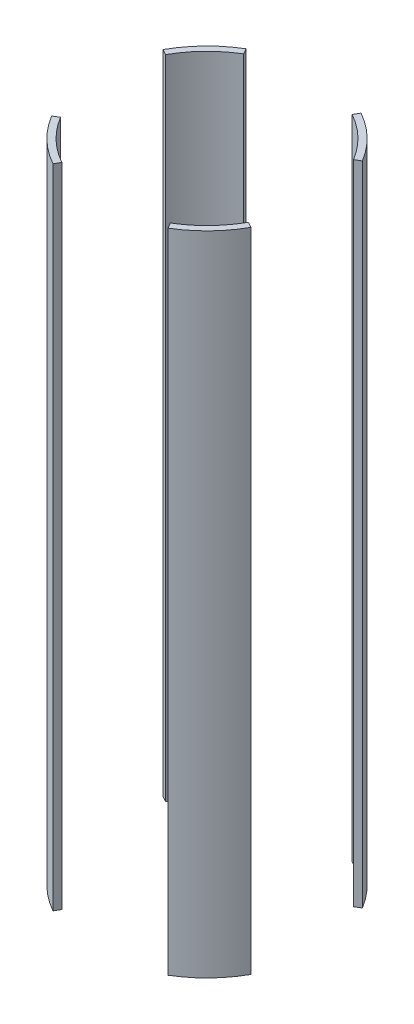
ISO-10303-21;
HEADER;
FILE_DESCRIPTION(('STEP AP214'),'2;1');
FILE_NAME('part.step','',(''),(''),'','','');
FILE_SCHEMA(('AUTOMOTIVE_DESIGN { 1 0 10303 214 1 1 1 1 }'));
ENDSEC;
DATA;
#1=APPLICATION_CONTEXT('core data for automotive mechanical design processes');
#2=APPLICATION_PROTOCOL_DEFINITION('international standard','automotive_design',2000,#1);
#3=PRODUCT_CONTEXT('',#1,'mechanical');
#4=PRODUCT('Part','Part','',(#3));
#5=PRODUCT_RELATED_PRODUCT_CATEGORY('part','',(#4));
#6=PRODUCT_DEFINITION_FORMATION('','',#4);
#7=PRODUCT_DEFINITION_CONTEXT('part definition',#1,'design');
#8=PRODUCT_DEFINITION('design','',#6,#7);
#9=PRODUCT_DEFINITION_SHAPE('','',#8);
#10=(LENGTH_UNIT() NAMED_UNIT(*) SI_UNIT(.MILLI.,.METRE.));
#11=(NAMED_UNIT(*) PLANE_ANGLE_UNIT() SI_UNIT($,.RADIAN.));
#12=(NAMED_UNIT(*) SI_UNIT($,.STERADIAN.) SOLID_ANGLE_UNIT());
#13=UNCERTAINTY_MEASURE_WITH_UNIT(LENGTH_MEASURE(1.E-05),#10,'distance_accuracy_value','');
#14=(GEOMETRIC_REPRESENTATION_CONTEXT(3) GLOBAL_UNCERTAINTY_ASSIGNED_CONTEXT((#13)) GLOBAL_UNIT_ASSIGNED_CONTEXT((#10,
#11,#12)) REPRESENTATION_CONTEXT('',''));
#15=CARTESIAN_POINT('',(0.,0.,0.));
#16=DIRECTION('',(0.,0.,1.));
#17=DIRECTION('',(1.,0.,0.));
#18=AXIS2_PLACEMENT_3D('',#15,#16,#17);
#19=CARTESIAN_POINT('',(0.,-254.,0.));
#20=DIRECTION('',(0.,1.,0.));
#21=DIRECTION('',(0.,0.,1.));
#22=AXIS2_PLACEMENT_3D('',#19,#20,#21);
#23=PLANE('',#22);
#24=DIRECTION('',(0.48581550952375,0.,-0.874061376967418));
#25=VECTOR('',#24,1.);
#26=CARTESIAN_POINT('',(0.,-254.,0.));
#27=LINE('',#26,#25);
#28=CARTESIAN_POINT('',(-43.1889987966614,-254.,77.7040564124034));
#29=VERTEX_POINT('',#28);
#30=CARTESIAN_POINT('',(-40.7210560082808,-254.,73.263824617409));
#31=VERTEX_POINT('',#30);
#32=EDGE_CURVE('E13',#29,#31,#27,.T.);
#33=ORIENTED_EDGE('',*,*,#32,.F.);
#34=CARTESIAN_POINT('',(0.,-254.,0.));
#35=DIRECTION('',(0.,1.,0.));
#36=DIRECTION('',(0.,0.,1.));
#37=AXIS2_PLACEMENT_3D('',#34,#35,#36);
#38=CIRCLE('',#37,88.9);
#39=CARTESIAN_POINT('',(-76.2547983281261,-254.,45.6991874319097));
#40=VERTEX_POINT('',#39);
#41=EDGE_CURVE('E274',#40,#29,#38,.T.);
#42=ORIENTED_EDGE('',*,*,#41,.F.);
#43=DIRECTION('',(0.857759261283758,0.,-0.514051602158714));
#44=VECTOR('',#43,1.);
#45=CARTESIAN_POINT('',(0.,-254.,0.));
#46=LINE('',#45,#44);
#47=CARTESIAN_POINT('',(-71.8973812808046,-254.,43.0878052929434));
#48=VERTEX_POINT('',#47);
#49=EDGE_CURVE('E269',#40,#48,#46,.T.);
#50=ORIENTED_EDGE('',*,*,#49,.T.);
#51=CARTESIAN_POINT('',(0.,-254.,0.));
#52=DIRECTION('',(0.,1.,0.));
#53=DIRECTION('',(0.,0.,1.));
#54=AXIS2_PLACEMENT_3D('',#51,#52,#53);
#55=CIRCLE('',#54,83.82);
#56=EDGE_CURVE('E228',#48,#31,#55,.T.);
#57=ORIENTED_EDGE('',*,*,#56,.T.);
#58=EDGE_LOOP('',(#33,#42,#50,#57));
#59=FACE_BOUND('',#58,.T.);
#60=ADVANCED_FACE('F225',(#59),#23,.F.);
#61=CARTESIAN_POINT('',(0.,254.,0.));
#62=DIRECTION('',(0.,1.,0.));
#63=DIRECTION('',(0.,0.,1.));
#64=AXIS2_PLACEMENT_3D('',#61,#62,#63);
#65=PLANE('',#64);
#66=CARTESIAN_POINT('',(0.,254.,0.));
#67=DIRECTION('',(0.,1.,0.));
#68=DIRECTION('',(0.,0.,1.));
#69=AXIS2_PLACEMENT_3D('',#66,#67,#68);
#70=CIRCLE('',#69,88.9);
#71=CARTESIAN_POINT('',(-76.2547983281261,254.,45.6991874319097));
#72=VERTEX_POINT('',#71);
#73=CARTESIAN_POINT('',(-43.1889987966614,254.,77.7040564124034));
#74=VERTEX_POINT('',#73);
#75=EDGE_CURVE('E280',#72,#74,#70,.T.);
#76=ORIENTED_EDGE('',*,*,#75,.T.);
#77=DIRECTION('',(0.48581550952375,0.,-0.874061376967418));
#78=VECTOR('',#77,1.);
#79=CARTESIAN_POINT('',(0.,254.,0.));
#80=LINE('',#79,#78);
#81=CARTESIAN_POINT('',(-40.7210560082808,254.,73.263824617409));
#82=VERTEX_POINT('',#81);
#83=EDGE_CURVE('E241',#74,#82,#80,.T.);
#84=ORIENTED_EDGE('',*,*,#83,.T.);
#85=CARTESIAN_POINT('',(0.,254.,0.));
#86=DIRECTION('',(0.,1.,0.));
#87=DIRECTION('',(0.,0.,1.));
#88=AXIS2_PLACEMENT_3D('',#85,#86,#87);
#89=CIRCLE('',#88,83.82);
#90=CARTESIAN_POINT('',(-71.8973812808046,254.,43.0878052929434));
#91=VERTEX_POINT('',#90);
#92=EDGE_CURVE('E282',#91,#82,#89,.T.);
#93=ORIENTED_EDGE('',*,*,#92,.F.);
#94=DIRECTION('',(0.857759261283758,0.,-0.514051602158714));
#95=VECTOR('',#94,1.);
#96=CARTESIAN_POINT('',(0.,254.,0.));
#97=LINE('',#96,#95);
#98=EDGE_CURVE('E266',#72,#91,#97,.T.);
#99=ORIENTED_EDGE('',*,*,#98,.F.);
#100=EDGE_LOOP('',(#76,#84,#93,#99));
#101=FACE_BOUND('',#100,.T.);
#102=ADVANCED_FACE('F279',(#101),#65,.T.);
#103=CARTESIAN_POINT('',(0.,254.,0.));
#104=DIRECTION('',(0.,-1.,0.));
#105=DIRECTION('',(0.,0.,-1.));
#106=AXIS2_PLACEMENT_3D('',#103,#104,#105);
#107=CYLINDRICAL_SURFACE('',#106,88.9);
#108=DIRECTION('',(0.,-1.,0.));
#109=VECTOR('',#108,1.);
#110=CARTESIAN_POINT('',(-43.1889987966614,254.,77.7040564124034));
#111=LINE('',#110,#109);
#112=EDGE_CURVE('E233',#74,#29,#111,.T.);
#113=ORIENTED_EDGE('',*,*,#112,.F.);
#114=ORIENTED_EDGE('',*,*,#75,.F.);
#115=DIRECTION('',(0.,-1.,0.));
#116=VECTOR('',#115,1.);
#117=CARTESIAN_POINT('',(-76.2547983281261,254.,45.6991874319097));
#118=LINE('',#117,#116);
#119=EDGE_CURVE('E263',#72,#40,#118,.T.);
#120=ORIENTED_EDGE('',*,*,#119,.T.);
#121=ORIENTED_EDGE('',*,*,#41,.T.);
#122=EDGE_LOOP('',(#113,#114,#120,#121));
#123=FACE_BOUND('',#122,.T.);
#124=ADVANCED_FACE('F285',(#123),#107,.T.);
#125=CARTESIAN_POINT('',(0.,254.,0.));
#126=DIRECTION('',(0.,-1.,0.));
#127=DIRECTION('',(0.,0.,-1.));
#128=AXIS2_PLACEMENT_3D('',#125,#126,#127);
#129=CYLINDRICAL_SURFACE('',#128,83.82);
#130=ORIENTED_EDGE('',*,*,#92,.T.);
#131=DIRECTION('',(0.,-1.,0.));
#132=VECTOR('',#131,1.);
#133=CARTESIAN_POINT('',(-40.7210560082808,254.,73.263824617409));
#134=LINE('',#133,#132);
#135=EDGE_CURVE('E245',#82,#31,#134,.T.);
#136=ORIENTED_EDGE('',*,*,#135,.T.);
#137=ORIENTED_EDGE('',*,*,#56,.F.);
#138=DIRECTION('',(0.,-1.,0.));
#139=VECTOR('',#138,1.);
#140=CARTESIAN_POINT('',(-71.8973812808046,254.,43.0878052929434));
#141=LINE('',#140,#139);
#142=EDGE_CURVE('E283',#91,#48,#141,.T.);
#143=ORIENTED_EDGE('',*,*,#142,.F.);
#144=EDGE_LOOP('',(#130,#136,#137,#143));
#145=FACE_BOUND('',#144,.T.);
#146=ADVANCED_FACE('F299',(#145),#129,.F.);
#147=CARTESIAN_POINT('',(0.,-254.,0.));
#148=DIRECTION('',(0.514051602158714,0.,0.857759261283758));
#149=DIRECTION('',(0.857759261283758,0.,-0.514051602158714));
#150=AXIS2_PLACEMENT_3D('',#147,#148,#149);
#151=PLANE('',#150);
#152=ORIENTED_EDGE('',*,*,#142,.T.);
#153=ORIENTED_EDGE('',*,*,#49,.F.);
#154=ORIENTED_EDGE('',*,*,#119,.F.);
#155=ORIENTED_EDGE('',*,*,#98,.T.);
#156=EDGE_LOOP('',(#152,#153,#154,#155));
#157=FACE_BOUND('',#156,.T.);
#158=ADVANCED_FACE('F265',(#157),#151,.F.);
#159=CARTESIAN_POINT('',(0.,-254.,0.));
#160=DIRECTION('',(0.874061376967418,0.,0.48581550952375));
#161=DIRECTION('',(0.48581550952375,0.,-0.874061376967418));
#162=AXIS2_PLACEMENT_3D('',#159,#160,#161);
#163=PLANE('',#162);
#164=ORIENTED_EDGE('',*,*,#112,.T.);
#165=ORIENTED_EDGE('',*,*,#32,.T.);
#166=ORIENTED_EDGE('',*,*,#135,.F.);
#167=ORIENTED_EDGE('',*,*,#83,.F.);
#168=EDGE_LOOP('',(#164,#165,#166,#167));
#169=FACE_BOUND('',#168,.T.);
#170=ADVANCED_FACE('F297',(#169),#163,.T.);
#171=CLOSED_SHELL('',(#60,#102,#124,#146,#158,#170));
#172=MANIFOLD_SOLID_BREP('B2',#171);
#173=CARTESIAN_POINT('',(0.,254.,0.));
#174=DIRECTION('',(0.,-1.,0.));
#175=DIRECTION('',(0.,0.,-1.));
#176=AXIS2_PLACEMENT_3D('',#173,#174,#175);
#177=CYLINDRICAL_SURFACE('',#176,83.82);
#178=DIRECTION('',(0.,-1.,0.));
#179=VECTOR('',#178,1.);
#180=CARTESIAN_POINT('',(-73.2638246174091,254.,-40.7210560082805));
#181=LINE('',#180,#179);
#182=CARTESIAN_POINT('',(-73.2638246174091,-254.,-40.7210560082805));
#183=VERTEX_POINT('',#182);
#184=CARTESIAN_POINT('',(-73.2638246174091,254.,-40.7210560082805));
#185=VERTEX_POINT('',#184);
#186=EDGE_CURVE('E367',#183,#185,#181,.F.);
#187=ORIENTED_EDGE('',*,*,#186,.F.);
#188=CARTESIAN_POINT('',(0.,-254.,0.));
#189=DIRECTION('',(0.,1.,0.));
#190=DIRECTION('',(0.,0.,1.));
#191=AXIS2_PLACEMENT_3D('',#188,#189,#190);
#192=CIRCLE('',#191,83.82);
#193=CARTESIAN_POINT('',(-43.0878052929431,-254.,-71.8973812808048));
#194=VERTEX_POINT('',#193);
#195=EDGE_CURVE('E361',#194,#183,#192,.T.);
#196=ORIENTED_EDGE('',*,*,#195,.F.);
#197=DIRECTION('',(0.,-1.,0.));
#198=VECTOR('',#197,1.);
#199=CARTESIAN_POINT('',(-43.0878052929431,254.,-71.8973812808048));
#200=LINE('',#199,#198);
#201=CARTESIAN_POINT('',(-43.0878052929431,254.,-71.8973812808048));
#202=VERTEX_POINT('',#201);
#203=EDGE_CURVE('E415',#202,#194,#200,.T.);
#204=ORIENTED_EDGE('',*,*,#203,.F.);
#205=CARTESIAN_POINT('',(0.,254.,0.));
#206=DIRECTION('',(0.,1.,0.));
#207=DIRECTION('',(0.,0.,1.));
#208=AXIS2_PLACEMENT_3D('',#205,#206,#207);
#209=CIRCLE('',#208,83.82);
#210=EDGE_CURVE('E421',#202,#185,#209,.T.);
#211=ORIENTED_EDGE('',*,*,#210,.T.);
#212=EDGE_LOOP('',(#187,#196,#204,#211));
#213=FACE_BOUND('',#212,.T.);
#214=ADVANCED_FACE('F358',(#213),#177,.F.);
#215=CARTESIAN_POINT('',(0.,254.,0.));
#216=DIRECTION('',(0.,-1.,0.));
#217=DIRECTION('',(0.,0.,-1.));
#218=AXIS2_PLACEMENT_3D('',#215,#216,#217);
#219=CYLINDRICAL_SURFACE('',#218,88.9);
#220=CARTESIAN_POINT('',(0.,-254.,0.));
#221=DIRECTION('',(0.,1.,0.));
#222=DIRECTION('',(0.,0.,1.));
#223=AXIS2_PLACEMENT_3D('',#220,#221,#222);
#224=CIRCLE('',#223,88.9);
#225=CARTESIAN_POINT('',(-45.6991874319094,-254.,-76.2547983281263));
#226=VERTEX_POINT('',#225);
#227=CARTESIAN_POINT('',(-77.7040564124036,-254.,-43.1889987966612));
#228=VERTEX_POINT('',#227);
#229=EDGE_CURVE('E407',#226,#228,#224,.T.);
#230=ORIENTED_EDGE('',*,*,#229,.T.);
#231=DIRECTION('',(0.,-1.,0.));
#232=VECTOR('',#231,1.);
#233=CARTESIAN_POINT('',(-77.7040564124036,254.,-43.1889987966611));
#234=LINE('',#233,#232);
#235=CARTESIAN_POINT('',(-77.7040564124036,254.,-43.1889987966612));
#236=VERTEX_POINT('',#235);
#237=EDGE_CURVE('E395',#228,#236,#234,.F.);
#238=ORIENTED_EDGE('',*,*,#237,.T.);
#239=CARTESIAN_POINT('',(0.,254.,0.));
#240=DIRECTION('',(0.,1.,0.));
#241=DIRECTION('',(0.,0.,1.));
#242=AXIS2_PLACEMENT_3D('',#239,#240,#241);
#243=CIRCLE('',#242,88.9);
#244=CARTESIAN_POINT('',(-45.6991874319094,254.,-76.2547983281263));
#245=VERTEX_POINT('',#244);
#246=EDGE_CURVE('E405',#245,#236,#243,.T.);
#247=ORIENTED_EDGE('',*,*,#246,.F.);
#248=DIRECTION('',(0.,-1.,0.));
#249=VECTOR('',#248,1.);
#250=CARTESIAN_POINT('',(-45.6991874319094,254.,-76.2547983281263));
#251=LINE('',#250,#249);
#252=EDGE_CURVE('E408',#245,#226,#251,.T.);
#253=ORIENTED_EDGE('',*,*,#252,.T.);
#254=EDGE_LOOP('',(#230,#238,#247,#253));
#255=FACE_BOUND('',#254,.T.);
#256=ADVANCED_FACE('F403',(#255),#219,.T.);
#257=CARTESIAN_POINT('',(0.,-254.,0.));
#258=DIRECTION('',(0.,1.,0.));
#259=DIRECTION('',(0.,0.,1.));
#260=AXIS2_PLACEMENT_3D('',#257,#258,#259);
#261=PLANE('',#260);
#262=ORIENTED_EDGE('',*,*,#195,.T.);
#263=DIRECTION('',(-0.87406137696742,0.,-0.485815509523748));
#264=VECTOR('',#263,1.);
#265=CARTESIAN_POINT('',(0.,-254.,0.));
#266=LINE('',#265,#264);
#267=EDGE_CURVE('E375',#183,#228,#266,.T.);
#268=ORIENTED_EDGE('',*,*,#267,.T.);
#269=ORIENTED_EDGE('',*,*,#229,.F.);
#270=DIRECTION('',(0.514051602158711,0.,0.85775926128376));
#271=VECTOR('',#270,1.);
#272=CARTESIAN_POINT('',(0.,-254.,0.));
#273=LINE('',#272,#271);
#274=EDGE_CURVE('E413',#226,#194,#273,.T.);
#275=ORIENTED_EDGE('',*,*,#274,.T.);
#276=EDGE_LOOP('',(#262,#268,#269,#275));
#277=FACE_BOUND('',#276,.T.);
#278=ADVANCED_FACE('F431',(#277),#261,.F.);
#279=CARTESIAN_POINT('',(0.,254.,0.));
#280=DIRECTION('',(0.,1.,0.));
#281=DIRECTION('',(0.,0.,1.));
#282=AXIS2_PLACEMENT_3D('',#279,#280,#281);
#283=PLANE('',#282);
#284=DIRECTION('',(-0.87406137696742,0.,-0.485815509523748));
#285=VECTOR('',#284,1.);
#286=CARTESIAN_POINT('',(0.,254.,0.));
#287=LINE('',#286,#285);
#288=EDGE_CURVE('E223',#185,#236,#287,.T.);
#289=ORIENTED_EDGE('',*,*,#288,.F.);
#290=ORIENTED_EDGE('',*,*,#210,.F.);
#291=DIRECTION('',(0.514051602158711,0.,0.85775926128376));
#292=VECTOR('',#291,1.);
#293=CARTESIAN_POINT('',(0.,254.,0.));
#294=LINE('',#293,#292);
#295=EDGE_CURVE('E412',#245,#202,#294,.T.);
#296=ORIENTED_EDGE('',*,*,#295,.F.);
#297=ORIENTED_EDGE('',*,*,#246,.T.);
#298=EDGE_LOOP('',(#289,#290,#296,#297));
#299=FACE_BOUND('',#298,.T.);
#300=ADVANCED_FACE('F411',(#299),#283,.T.);
#301=CARTESIAN_POINT('',(0.,-254.,0.));
#302=DIRECTION('',(-0.85775926128376,0.,0.514051602158711));
#303=DIRECTION('',(0.514051602158711,0.,0.85775926128376));
#304=AXIS2_PLACEMENT_3D('',#301,#302,#303);
#305=PLANE('',#304);
#306=ORIENTED_EDGE('',*,*,#295,.T.);
#307=ORIENTED_EDGE('',*,*,#203,.T.);
#308=ORIENTED_EDGE('',*,*,#274,.F.);
#309=ORIENTED_EDGE('',*,*,#252,.F.);
#310=EDGE_LOOP('',(#306,#307,#308,#309));
#311=FACE_BOUND('',#310,.T.);
#312=ADVANCED_FACE('F432',(#311),#305,.F.);
#313=CARTESIAN_POINT('',(0.,-254.,0.));
#314=DIRECTION('',(0.485815509523747,0.,-0.87406137696742));
#315=DIRECTION('',(-0.87406137696742,0.,-0.485815509523748));
#316=AXIS2_PLACEMENT_3D('',#313,#314,#315);
#317=PLANE('',#316);
#318=ORIENTED_EDGE('',*,*,#186,.T.);
#319=ORIENTED_EDGE('',*,*,#288,.T.);
#320=ORIENTED_EDGE('',*,*,#237,.F.);
#321=ORIENTED_EDGE('',*,*,#267,.F.);
#322=EDGE_LOOP('',(#318,#319,#320,#321));
#323=FACE_BOUND('',#322,.T.);
#324=ADVANCED_FACE('F394',(#323),#317,.F.);
#325=CLOSED_SHELL('',(#214,#256,#278,#300,#312,#324));
#326=MANIFOLD_SOLID_BREP('B7',#325);
#327=CARTESIAN_POINT('',(0.,254.,0.));
#328=DIRECTION('',(0.,1.,0.));
#329=DIRECTION('',(0.,0.,1.));
#330=AXIS2_PLACEMENT_3D('',#327,#328,#329);
#331=PLANE('',#330);
#332=DIRECTION('',(0.485815509523751,0.,-0.874061376967418));
#333=VECTOR('',#332,1.);
#334=CARTESIAN_POINT('',(0.,254.,0.));
#335=LINE('',#334,#333);
#336=CARTESIAN_POINT('',(40.7210560082808,254.,-73.2638246174089));
#337=VERTEX_POINT('',#336);
#338=CARTESIAN_POINT('',(43.1889987966614,254.,-77.7040564124034));
#339=VERTEX_POINT('',#338);
#340=EDGE_CURVE('E356',#337,#339,#335,.T.);
#341=ORIENTED_EDGE('',*,*,#340,.F.);
#342=CARTESIAN_POINT('',(0.,254.,0.));
#343=DIRECTION('',(0.,1.,0.));
#344=DIRECTION('',(0.,0.,1.));
#345=AXIS2_PLACEMENT_3D('',#342,#343,#344);
#346=CIRCLE('',#345,83.82);
#347=CARTESIAN_POINT('',(71.8973812808046,254.,-43.0878052929434));
#348=VERTEX_POINT('',#347);
#349=EDGE_CURVE('E538',#348,#337,#346,.T.);
#350=ORIENTED_EDGE('',*,*,#349,.F.);
#351=DIRECTION('',(0.857759261283759,0.,-0.514051602158714));
#352=VECTOR('',#351,1.);
#353=CARTESIAN_POINT('',(0.,254.,0.));
#354=LINE('',#353,#352);
#355=CARTESIAN_POINT('',(76.2547983281261,254.,-45.6991874319097));
#356=VERTEX_POINT('',#355);
#357=EDGE_CURVE('E551',#348,#356,#354,.T.);
#358=ORIENTED_EDGE('',*,*,#357,.T.);
#359=CARTESIAN_POINT('',(0.,254.,0.));
#360=DIRECTION('',(0.,1.,0.));
#361=DIRECTION('',(0.,0.,1.));
#362=AXIS2_PLACEMENT_3D('',#359,#360,#361);
#363=CIRCLE('',#362,88.9);
#364=EDGE_CURVE('E540',#356,#339,#363,.T.);
#365=ORIENTED_EDGE('',*,*,#364,.T.);
#366=EDGE_LOOP('',(#341,#350,#358,#365));
#367=FACE_BOUND('',#366,.T.);
#368=ADVANCED_FACE('F490',(#367),#331,.T.);
#369=CARTESIAN_POINT('',(0.,-254.,0.));
#370=DIRECTION('',(0.,1.,0.));
#371=DIRECTION('',(0.,0.,1.));
#372=AXIS2_PLACEMENT_3D('',#369,#370,#371);
#373=PLANE('',#372);
#374=CARTESIAN_POINT('',(0.,-254.,0.));
#375=DIRECTION('',(0.,1.,0.));
#376=DIRECTION('',(0.,0.,1.));
#377=AXIS2_PLACEMENT_3D('',#374,#375,#376);
#378=CIRCLE('',#377,83.82);
#379=CARTESIAN_POINT('',(71.8973812808046,-254.,-43.0878052929434));
#380=VERTEX_POINT('',#379);
#381=CARTESIAN_POINT('',(40.7210560082808,-254.,-73.2638246174089));
#382=VERTEX_POINT('',#381);
#383=EDGE_CURVE('E493',#380,#382,#378,.T.);
#384=ORIENTED_EDGE('',*,*,#383,.T.);
#385=DIRECTION('',(0.485815509523751,0.,-0.874061376967418));
#386=VECTOR('',#385,1.);
#387=CARTESIAN_POINT('',(0.,-254.,0.));
#388=LINE('',#387,#386);
#389=CARTESIAN_POINT('',(43.1889987966614,-254.,-77.7040564124034));
#390=VERTEX_POINT('',#389);
#391=EDGE_CURVE('E524',#382,#390,#388,.T.);
#392=ORIENTED_EDGE('',*,*,#391,.T.);
#393=CARTESIAN_POINT('',(0.,-254.,0.));
#394=DIRECTION('',(0.,1.,0.));
#395=DIRECTION('',(0.,0.,1.));
#396=AXIS2_PLACEMENT_3D('',#393,#394,#395);
#397=CIRCLE('',#396,88.9);
#398=CARTESIAN_POINT('',(76.2547983281261,-254.,-45.6991874319097));
#399=VERTEX_POINT('',#398);
#400=EDGE_CURVE('E548',#399,#390,#397,.T.);
#401=ORIENTED_EDGE('',*,*,#400,.F.);
#402=DIRECTION('',(0.857759261283759,0.,-0.514051602158714));
#403=VECTOR('',#402,1.);
#404=CARTESIAN_POINT('',(0.,-254.,0.));
#405=LINE('',#404,#403);
#406=EDGE_CURVE('E532',#380,#399,#405,.T.);
#407=ORIENTED_EDGE('',*,*,#406,.F.);
#408=EDGE_LOOP('',(#384,#392,#401,#407));
#409=FACE_BOUND('',#408,.T.);
#410=ADVANCED_FACE('F564',(#409),#373,.F.);
#411=CARTESIAN_POINT('',(0.,254.,0.));
#412=DIRECTION('',(0.,-1.,0.));
#413=DIRECTION('',(0.,0.,-1.));
#414=AXIS2_PLACEMENT_3D('',#411,#412,#413);
#415=CYLINDRICAL_SURFACE('',#414,88.9);
#416=ORIENTED_EDGE('',*,*,#400,.T.);
#417=DIRECTION('',(0.,-1.,0.));
#418=VECTOR('',#417,1.);
#419=CARTESIAN_POINT('',(43.1889987966614,254.,-77.7040564124034));
#420=LINE('',#419,#418);
#421=EDGE_CURVE('E507',#390,#339,#420,.F.);
#422=ORIENTED_EDGE('',*,*,#421,.T.);
#423=ORIENTED_EDGE('',*,*,#364,.F.);
#424=DIRECTION('',(0.,-1.,0.));
#425=VECTOR('',#424,1.);
#426=CARTESIAN_POINT('',(76.2547983281261,254.,-45.6991874319097));
#427=LINE('',#426,#425);
#428=EDGE_CURVE('E544',#399,#356,#427,.F.);
#429=ORIENTED_EDGE('',*,*,#428,.F.);
#430=EDGE_LOOP('',(#416,#422,#423,#429));
#431=FACE_BOUND('',#430,.T.);
#432=ADVANCED_FACE('F563',(#431),#415,.T.);
#433=CARTESIAN_POINT('',(0.,254.,0.));
#434=DIRECTION('',(0.,-1.,0.));
#435=DIRECTION('',(0.,0.,-1.));
#436=AXIS2_PLACEMENT_3D('',#433,#434,#435);
#437=CYLINDRICAL_SURFACE('',#436,83.82);
#438=DIRECTION('',(0.,-1.,0.));
#439=VECTOR('',#438,1.);
#440=CARTESIAN_POINT('',(40.7210560082808,254.,-73.2638246174089));
#441=LINE('',#440,#439);
#442=EDGE_CURVE('E499',#382,#337,#441,.F.);
#443=ORIENTED_EDGE('',*,*,#442,.F.);
#444=ORIENTED_EDGE('',*,*,#383,.F.);
#445=DIRECTION('',(0.,-1.,0.));
#446=VECTOR('',#445,1.);
#447=CARTESIAN_POINT('',(71.8973812808046,254.,-43.0878052929434));
#448=LINE('',#447,#446);
#449=EDGE_CURVE('E543',#380,#348,#448,.F.);
#450=ORIENTED_EDGE('',*,*,#449,.T.);
#451=ORIENTED_EDGE('',*,*,#349,.T.);
#452=EDGE_LOOP('',(#443,#444,#450,#451));
#453=FACE_BOUND('',#452,.T.);
#454=ADVANCED_FACE('F542',(#453),#437,.F.);
#455=CARTESIAN_POINT('',(0.,-254.,0.));
#456=DIRECTION('',(0.514051602158714,0.,0.857759261283759));
#457=DIRECTION('',(0.857759261283759,0.,-0.514051602158714));
#458=AXIS2_PLACEMENT_3D('',#455,#456,#457);
#459=PLANE('',#458);
#460=ORIENTED_EDGE('',*,*,#428,.T.);
#461=ORIENTED_EDGE('',*,*,#357,.F.);
#462=ORIENTED_EDGE('',*,*,#449,.F.);
#463=ORIENTED_EDGE('',*,*,#406,.T.);
#464=EDGE_LOOP('',(#460,#461,#462,#463));
#465=FACE_BOUND('',#464,.T.);
#466=ADVANCED_FACE('F559',(#465),#459,.T.);
#467=CARTESIAN_POINT('',(0.,-254.,0.));
#468=DIRECTION('',(0.874061376967418,0.,0.485815509523751));
#469=DIRECTION('',(0.485815509523751,0.,-0.874061376967418));
#470=AXIS2_PLACEMENT_3D('',#467,#468,#469);
#471=PLANE('',#470);
#472=ORIENTED_EDGE('',*,*,#391,.F.);
#473=ORIENTED_EDGE('',*,*,#442,.T.);
#474=ORIENTED_EDGE('',*,*,#340,.T.);
#475=ORIENTED_EDGE('',*,*,#421,.F.);
#476=EDGE_LOOP('',(#472,#473,#474,#475));
#477=FACE_BOUND('',#476,.T.);
#478=ADVANCED_FACE('F527',(#477),#471,.F.);
#479=CLOSED_SHELL('',(#368,#410,#432,#454,#466,#478));
#480=MANIFOLD_SOLID_BREP('B217',#479);
#481=CARTESIAN_POINT('',(0.,-254.,0.));
#482=DIRECTION('',(0.485815509523748,0.,-0.87406137696742));
#483=DIRECTION('',(-0.87406137696742,0.,-0.485815509523748));
#484=AXIS2_PLACEMENT_3D('',#481,#482,#483);
#485=PLANE('',#484);
#486=DIRECTION('',(0.,-1.,0.));
#487=VECTOR('',#486,1.);
#488=CARTESIAN_POINT('',(77.7040564124036,254.,43.1889987966612));
#489=LINE('',#488,#487);
#490=CARTESIAN_POINT('',(77.7040564124036,254.,43.1889987966612));
#491=VERTEX_POINT('',#490);
#492=CARTESIAN_POINT('',(77.7040564124036,-254.,43.1889987966612));
#493=VERTEX_POINT('',#492);
#494=EDGE_CURVE('E671',#491,#493,#489,.T.);
#495=ORIENTED_EDGE('',*,*,#494,.T.);
#496=DIRECTION('',(-0.87406137696742,0.,-0.485815509523748));
#497=VECTOR('',#496,1.);
#498=CARTESIAN_POINT('',(0.,-254.,0.));
#499=LINE('',#498,#497);
#500=CARTESIAN_POINT('',(73.2638246174091,-254.,40.7210560082805));
#501=VERTEX_POINT('',#500);
#502=EDGE_CURVE('E680',#493,#501,#499,.T.);
#503=ORIENTED_EDGE('',*,*,#502,.T.);
#504=DIRECTION('',(0.,-1.,0.));
#505=VECTOR('',#504,1.);
#506=CARTESIAN_POINT('',(73.2638246174091,254.,40.7210560082805));
#507=LINE('',#506,#505);
#508=CARTESIAN_POINT('',(73.2638246174091,254.,40.7210560082805));
#509=VERTEX_POINT('',#508);
#510=EDGE_CURVE('E621',#509,#501,#507,.T.);
#511=ORIENTED_EDGE('',*,*,#510,.F.);
#512=DIRECTION('',(-0.87406137696742,0.,-0.485815509523748));
#513=VECTOR('',#512,1.);
#514=CARTESIAN_POINT('',(0.,254.,0.));
#515=LINE('',#514,#513);
#516=EDGE_CURVE('E659',#491,#509,#515,.T.);
#517=ORIENTED_EDGE('',*,*,#516,.F.);
#518=EDGE_LOOP('',(#495,#503,#511,#517));
#519=FACE_BOUND('',#518,.T.);
#520=ADVANCED_FACE('F613',(#519),#485,.T.);
#521=CARTESIAN_POINT('',(0.,254.,0.));
#522=DIRECTION('',(0.,-1.,0.));
#523=DIRECTION('',(0.,0.,-1.));
#524=AXIS2_PLACEMENT_3D('',#521,#522,#523);
#525=CYLINDRICAL_SURFACE('',#524,88.9);
#526=DIRECTION('',(0.,-1.,0.));
#527=VECTOR('',#526,1.);
#528=CARTESIAN_POINT('',(45.6991874319094,254.,76.2547983281263));
#529=LINE('',#528,#527);
#530=CARTESIAN_POINT('',(45.6991874319095,-254.,76.2547983281263));
#531=VERTEX_POINT('',#530);
#532=CARTESIAN_POINT('',(45.6991874319095,254.,76.2547983281263));
#533=VERTEX_POINT('',#532);
#534=EDGE_CURVE('E653',#531,#533,#529,.F.);
#535=ORIENTED_EDGE('',*,*,#534,.F.);
#536=CARTESIAN_POINT('',(0.,-254.,0.));
#537=DIRECTION('',(0.,1.,0.));
#538=DIRECTION('',(0.,0.,1.));
#539=AXIS2_PLACEMENT_3D('',#536,#537,#538);
#540=CIRCLE('',#539,88.9);
#541=EDGE_CURVE('E672',#531,#493,#540,.T.);
#542=ORIENTED_EDGE('',*,*,#541,.T.);
#543=ORIENTED_EDGE('',*,*,#494,.F.);
#544=CARTESIAN_POINT('',(0.,254.,0.));
#545=DIRECTION('',(0.,1.,0.));
#546=DIRECTION('',(0.,0.,1.));
#547=AXIS2_PLACEMENT_3D('',#544,#545,#546);
#548=CIRCLE('',#547,88.9);
#549=EDGE_CURVE('E665',#533,#491,#548,.T.);
#550=ORIENTED_EDGE('',*,*,#549,.F.);
#551=EDGE_LOOP('',(#535,#542,#543,#550));
#552=FACE_BOUND('',#551,.T.);
#553=ADVANCED_FACE('F615',(#552),#525,.T.);
#554=CARTESIAN_POINT('',(0.,254.,0.));
#555=DIRECTION('',(0.,-1.,0.));
#556=DIRECTION('',(0.,0.,-1.));
#557=AXIS2_PLACEMENT_3D('',#554,#555,#556);
#558=CYLINDRICAL_SURFACE('',#557,83.82);
#559=CARTESIAN_POINT('',(0.,-254.,0.));
#560=DIRECTION('',(0.,1.,0.));
#561=DIRECTION('',(0.,0.,1.));
#562=AXIS2_PLACEMENT_3D('',#559,#560,#561);
#563=CIRCLE('',#562,83.82);
#564=CARTESIAN_POINT('',(43.0878052929432,-254.,71.8973812808048));
#565=VERTEX_POINT('',#564);
#566=EDGE_CURVE('E635',#565,#501,#563,.T.);
#567=ORIENTED_EDGE('',*,*,#566,.F.);
#568=DIRECTION('',(0.,-1.,0.));
#569=VECTOR('',#568,1.);
#570=CARTESIAN_POINT('',(43.0878052929432,254.,71.8973812808048));
#571=LINE('',#570,#569);
#572=CARTESIAN_POINT('',(43.0878052929432,254.,71.8973812808048));
#573=VERTEX_POINT('',#572);
#574=EDGE_CURVE('E488',#565,#573,#571,.F.);
#575=ORIENTED_EDGE('',*,*,#574,.T.);
#576=CARTESIAN_POINT('',(0.,254.,0.));
#577=DIRECTION('',(0.,1.,0.));
#578=DIRECTION('',(0.,0.,1.));
#579=AXIS2_PLACEMENT_3D('',#576,#577,#578);
#580=CIRCLE('',#579,83.82);
#581=EDGE_CURVE('E667',#573,#509,#580,.T.);
#582=ORIENTED_EDGE('',*,*,#581,.T.);
#583=ORIENTED_EDGE('',*,*,#510,.T.);
#584=EDGE_LOOP('',(#567,#575,#582,#583));
#585=FACE_BOUND('',#584,.T.);
#586=ADVANCED_FACE('F686',(#585),#558,.F.);
#587=CARTESIAN_POINT('',(0.,254.,0.));
#588=DIRECTION('',(0.,1.,0.));
#589=DIRECTION('',(0.,0.,1.));
#590=AXIS2_PLACEMENT_3D('',#587,#588,#589);
#591=PLANE('',#590);
#592=ORIENTED_EDGE('',*,*,#581,.F.);
#593=DIRECTION('',(0.514051602158711,0.,0.85775926128376));
#594=VECTOR('',#593,1.);
#595=CARTESIAN_POINT('',(0.,254.,0.));
#596=LINE('',#595,#594);
#597=EDGE_CURVE('E628',#573,#533,#596,.T.);
#598=ORIENTED_EDGE('',*,*,#597,.T.);
#599=ORIENTED_EDGE('',*,*,#549,.T.);
#600=ORIENTED_EDGE('',*,*,#516,.T.);
#601=EDGE_LOOP('',(#592,#598,#599,#600));
#602=FACE_BOUND('',#601,.T.);
#603=ADVANCED_FACE('F663',(#602),#591,.T.);
#604=CARTESIAN_POINT('',(0.,-254.,0.));
#605=DIRECTION('',(0.,1.,0.));
#606=DIRECTION('',(0.,0.,1.));
#607=AXIS2_PLACEMENT_3D('',#604,#605,#606);
#608=PLANE('',#607);
#609=DIRECTION('',(0.514051602158711,0.,0.85775926128376));
#610=VECTOR('',#609,1.);
#611=CARTESIAN_POINT('',(0.,-254.,0.));
#612=LINE('',#611,#610);
#613=EDGE_CURVE('E655',#565,#531,#612,.T.);
#614=ORIENTED_EDGE('',*,*,#613,.F.);
#615=ORIENTED_EDGE('',*,*,#566,.T.);
#616=ORIENTED_EDGE('',*,*,#502,.F.);
#617=ORIENTED_EDGE('',*,*,#541,.F.);
#618=EDGE_LOOP('',(#614,#615,#616,#617));
#619=FACE_BOUND('',#618,.T.);
#620=ADVANCED_FACE('F687',(#619),#608,.F.);
#621=CARTESIAN_POINT('',(0.,-254.,0.));
#622=DIRECTION('',(-0.85775926128376,0.,0.514051602158711));
#623=DIRECTION('',(0.514051602158711,0.,0.85775926128376));
#624=AXIS2_PLACEMENT_3D('',#621,#622,#623);
#625=PLANE('',#624);
#626=ORIENTED_EDGE('',*,*,#534,.T.);
#627=ORIENTED_EDGE('',*,*,#597,.F.);
#628=ORIENTED_EDGE('',*,*,#574,.F.);
#629=ORIENTED_EDGE('',*,*,#613,.T.);
#630=EDGE_LOOP('',(#626,#627,#628,#629));
#631=FACE_BOUND('',#630,.T.);
#632=ADVANCED_FACE('F654',(#631),#625,.T.);
#633=CLOSED_SHELL('',(#520,#553,#586,#603,#620,#632));
#634=MANIFOLD_SOLID_BREP('B350',#633);
#635=ADVANCED_BREP_SHAPE_REPRESENTATION('',(#18,#172,#326,#480,#634),#14);
#636=SHAPE_DEFINITION_REPRESENTATION(#9,#635);
ENDSEC;
END-ISO-10303-21;
